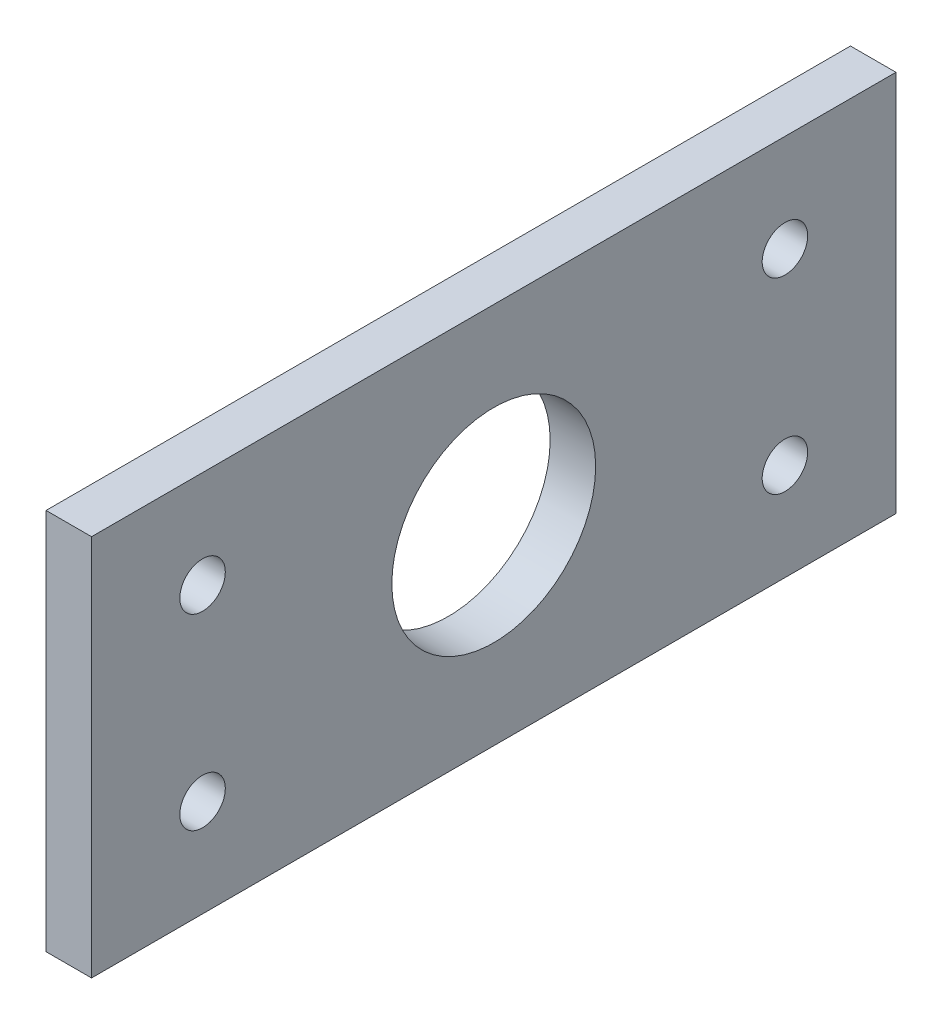
ISO-10303-21;
HEADER;
FILE_DESCRIPTION(('STEP AP214'),'2;1');
FILE_NAME('part.step','',(''),(''),'','','');
FILE_SCHEMA(('AUTOMOTIVE_DESIGN { 1 0 10303 214 1 1 1 1 }'));
ENDSEC;
DATA;
#1=APPLICATION_CONTEXT('core data for automotive mechanical design processes');
#2=APPLICATION_PROTOCOL_DEFINITION('international standard','automotive_design',2000,#1);
#3=PRODUCT_CONTEXT('',#1,'mechanical');
#4=PRODUCT('Part','Part','',(#3));
#5=PRODUCT_RELATED_PRODUCT_CATEGORY('part','',(#4));
#6=PRODUCT_DEFINITION_FORMATION('','',#4);
#7=PRODUCT_DEFINITION_CONTEXT('part definition',#1,'design');
#8=PRODUCT_DEFINITION('design','',#6,#7);
#9=PRODUCT_DEFINITION_SHAPE('','',#8);
#10=(LENGTH_UNIT() NAMED_UNIT(*) SI_UNIT(.MILLI.,.METRE.));
#11=(NAMED_UNIT(*) PLANE_ANGLE_UNIT() SI_UNIT($,.RADIAN.));
#12=(NAMED_UNIT(*) SI_UNIT($,.STERADIAN.) SOLID_ANGLE_UNIT());
#13=UNCERTAINTY_MEASURE_WITH_UNIT(LENGTH_MEASURE(1.E-05),#10,'distance_accuracy_value','');
#14=(GEOMETRIC_REPRESENTATION_CONTEXT(3) GLOBAL_UNCERTAINTY_ASSIGNED_CONTEXT((#13)) GLOBAL_UNIT_ASSIGNED_CONTEXT((#10,
#11,#12)) REPRESENTATION_CONTEXT('',''));
#15=CARTESIAN_POINT('',(0.,0.,0.));
#16=DIRECTION('',(0.,0.,1.));
#17=DIRECTION('',(1.,0.,0.));
#18=AXIS2_PLACEMENT_3D('',#15,#16,#17);
#19=CARTESIAN_POINT('',(6.35,0.,0.));
#20=DIRECTION('',(-1.,0.,0.));
#21=DIRECTION('',(0.,0.,1.));
#22=AXIS2_PLACEMENT_3D('',#19,#20,#21);
#23=PLANE('',#22);
#24=DIRECTION('',(0.,1.,0.));
#25=VECTOR('',#24,1.);
#26=CARTESIAN_POINT('',(6.35,-26.67,-56.134));
#27=LINE('',#26,#25);
#28=CARTESIAN_POINT('',(6.35,-26.67,-56.134));
#29=VERTEX_POINT('',#28);
#30=CARTESIAN_POINT('',(6.35,26.67,-56.134));
#31=VERTEX_POINT('',#30);
#32=EDGE_CURVE('E87',#29,#31,#27,.T.);
#33=ORIENTED_EDGE('',*,*,#32,.T.);
#34=DIRECTION('',(0.,0.,1.));
#35=VECTOR('',#34,1.);
#36=CARTESIAN_POINT('',(6.35,26.67,56.134));
#37=LINE('',#36,#35);
#38=CARTESIAN_POINT('',(6.35,26.67,56.134));
#39=VERTEX_POINT('',#38);
#40=EDGE_CURVE('E82',#31,#39,#37,.T.);
#41=ORIENTED_EDGE('',*,*,#40,.T.);
#42=DIRECTION('',(0.,-1.,0.));
#43=VECTOR('',#42,1.);
#44=CARTESIAN_POINT('',(6.35,-26.67,56.134));
#45=LINE('',#44,#43);
#46=CARTESIAN_POINT('',(6.35,-26.67,56.134));
#47=VERTEX_POINT('',#46);
#48=EDGE_CURVE('E85',#39,#47,#45,.T.);
#49=ORIENTED_EDGE('',*,*,#48,.T.);
#50=DIRECTION('',(0.,0.,-1.));
#51=VECTOR('',#50,1.);
#52=CARTESIAN_POINT('',(6.35,-26.67,56.134));
#53=LINE('',#52,#51);
#54=EDGE_CURVE('E52',#47,#29,#53,.T.);
#55=ORIENTED_EDGE('',*,*,#54,.T.);
#56=EDGE_LOOP('',(#33,#41,#49,#55));
#57=FACE_BOUND('',#56,.T.);
#58=CARTESIAN_POINT('',(6.35,0.,0.));
#59=DIRECTION('',(1.,0.,0.));
#60=DIRECTION('',(0.,0.,-1.));
#61=AXIS2_PLACEMENT_3D('',#58,#59,#60);
#62=CIRCLE('',#61,14.224);
#63=CARTESIAN_POINT('',(6.35,0.,-14.224));
#64=VERTEX_POINT('',#63);
#65=EDGE_CURVE('E102',#64,#64,#62,.T.);
#66=ORIENTED_EDGE('',*,*,#65,.F.);
#67=EDGE_LOOP('',(#66));
#68=FACE_BOUND('',#67,.T.);
#69=CARTESIAN_POINT('',(6.35,-13.081,40.64));
#70=DIRECTION('',(1.,0.,0.));
#71=DIRECTION('',(0.,0.,-1.));
#72=AXIS2_PLACEMENT_3D('',#69,#70,#71);
#73=CIRCLE('',#72,3.175);
#74=CARTESIAN_POINT('',(6.35,-13.081,37.465));
#75=VERTEX_POINT('',#74);
#76=EDGE_CURVE('E117',#75,#75,#73,.T.);
#77=ORIENTED_EDGE('',*,*,#76,.F.);
#78=EDGE_LOOP('',(#77));
#79=FACE_BOUND('',#78,.T.);
#80=CARTESIAN_POINT('',(6.35,-13.081,-40.64));
#81=DIRECTION('',(1.,0.,0.));
#82=DIRECTION('',(0.,0.,-1.));
#83=AXIS2_PLACEMENT_3D('',#80,#81,#82);
#84=CIRCLE('',#83,3.175);
#85=CARTESIAN_POINT('',(6.35,-13.081,-43.815));
#86=VERTEX_POINT('',#85);
#87=EDGE_CURVE('E123',#86,#86,#84,.T.);
#88=ORIENTED_EDGE('',*,*,#87,.F.);
#89=EDGE_LOOP('',(#88));
#90=FACE_BOUND('',#89,.T.);
#91=CARTESIAN_POINT('',(6.35,13.081,40.64));
#92=DIRECTION('',(1.,0.,0.));
#93=DIRECTION('',(0.,0.,-1.));
#94=AXIS2_PLACEMENT_3D('',#91,#92,#93);
#95=CIRCLE('',#94,3.175);
#96=CARTESIAN_POINT('',(6.35,13.081,37.465));
#97=VERTEX_POINT('',#96);
#98=EDGE_CURVE('E129',#97,#97,#95,.T.);
#99=ORIENTED_EDGE('',*,*,#98,.F.);
#100=EDGE_LOOP('',(#99));
#101=FACE_BOUND('',#100,.T.);
#102=CARTESIAN_POINT('',(6.35,13.081,-40.64));
#103=DIRECTION('',(1.,0.,0.));
#104=DIRECTION('',(0.,0.,-1.));
#105=AXIS2_PLACEMENT_3D('',#102,#103,#104);
#106=CIRCLE('',#105,3.175);
#107=CARTESIAN_POINT('',(6.35,13.081,-43.815));
#108=VERTEX_POINT('',#107);
#109=EDGE_CURVE('E135',#108,#108,#106,.T.);
#110=ORIENTED_EDGE('',*,*,#109,.F.);
#111=EDGE_LOOP('',(#110));
#112=FACE_BOUND('',#111,.T.);
#113=ADVANCED_FACE('F35',(#57,#68,#79,#90,#101,#112),#23,.F.);
#114=CARTESIAN_POINT('',(0.,0.,0.));
#115=DIRECTION('',(-1.,0.,0.));
#116=DIRECTION('',(0.,0.,1.));
#117=AXIS2_PLACEMENT_3D('',#114,#115,#116);
#118=PLANE('',#117);
#119=CARTESIAN_POINT('',(0.,13.081,40.64));
#120=DIRECTION('',(1.,0.,0.));
#121=DIRECTION('',(0.,0.,-1.));
#122=AXIS2_PLACEMENT_3D('',#119,#120,#121);
#123=CIRCLE('',#122,3.175);
#124=CARTESIAN_POINT('',(0.,13.081,37.465));
#125=VERTEX_POINT('',#124);
#126=EDGE_CURVE('E132',#125,#125,#123,.T.);
#127=ORIENTED_EDGE('',*,*,#126,.T.);
#128=EDGE_LOOP('',(#127));
#129=FACE_BOUND('',#128,.T.);
#130=CARTESIAN_POINT('',(0.,-13.081,40.64));
#131=DIRECTION('',(1.,0.,0.));
#132=DIRECTION('',(0.,0.,-1.));
#133=AXIS2_PLACEMENT_3D('',#130,#131,#132);
#134=CIRCLE('',#133,3.175);
#135=CARTESIAN_POINT('',(0.,-13.081,37.465));
#136=VERTEX_POINT('',#135);
#137=EDGE_CURVE('E120',#136,#136,#134,.T.);
#138=ORIENTED_EDGE('',*,*,#137,.T.);
#139=EDGE_LOOP('',(#138));
#140=FACE_BOUND('',#139,.T.);
#141=DIRECTION('',(0.,1.,0.));
#142=VECTOR('',#141,1.);
#143=CARTESIAN_POINT('',(0.,-26.67,-56.134));
#144=LINE('',#143,#142);
#145=CARTESIAN_POINT('',(0.,-26.67,-56.134));
#146=VERTEX_POINT('',#145);
#147=CARTESIAN_POINT('',(0.,26.67,-56.134));
#148=VERTEX_POINT('',#147);
#149=EDGE_CURVE('E99',#146,#148,#144,.T.);
#150=ORIENTED_EDGE('',*,*,#149,.F.);
#151=DIRECTION('',(0.,0.,-1.));
#152=VECTOR('',#151,1.);
#153=CARTESIAN_POINT('',(0.,-26.67,56.134));
#154=LINE('',#153,#152);
#155=CARTESIAN_POINT('',(0.,-26.67,56.134));
#156=VERTEX_POINT('',#155);
#157=EDGE_CURVE('E75',#156,#146,#154,.T.);
#158=ORIENTED_EDGE('',*,*,#157,.F.);
#159=DIRECTION('',(0.,-1.,0.));
#160=VECTOR('',#159,1.);
#161=CARTESIAN_POINT('',(0.,-26.67,56.134));
#162=LINE('',#161,#160);
#163=CARTESIAN_POINT('',(0.,26.67,56.134));
#164=VERTEX_POINT('',#163);
#165=EDGE_CURVE('E69',#164,#156,#162,.T.);
#166=ORIENTED_EDGE('',*,*,#165,.F.);
#167=DIRECTION('',(0.,0.,1.));
#168=VECTOR('',#167,1.);
#169=CARTESIAN_POINT('',(0.,26.67,56.134));
#170=LINE('',#169,#168);
#171=EDGE_CURVE('E91',#148,#164,#170,.T.);
#172=ORIENTED_EDGE('',*,*,#171,.F.);
#173=EDGE_LOOP('',(#150,#158,#166,#172));
#174=FACE_BOUND('',#173,.T.);
#175=CARTESIAN_POINT('',(0.,0.,0.));
#176=DIRECTION('',(1.,0.,0.));
#177=DIRECTION('',(0.,0.,-1.));
#178=AXIS2_PLACEMENT_3D('',#175,#176,#177);
#179=CIRCLE('',#178,14.224);
#180=CARTESIAN_POINT('',(0.,0.,-14.224));
#181=VERTEX_POINT('',#180);
#182=EDGE_CURVE('E114',#181,#181,#179,.T.);
#183=ORIENTED_EDGE('',*,*,#182,.T.);
#184=EDGE_LOOP('',(#183));
#185=FACE_BOUND('',#184,.T.);
#186=CARTESIAN_POINT('',(0.,-13.081,-40.64));
#187=DIRECTION('',(1.,0.,0.));
#188=DIRECTION('',(0.,0.,-1.));
#189=AXIS2_PLACEMENT_3D('',#186,#187,#188);
#190=CIRCLE('',#189,3.175);
#191=CARTESIAN_POINT('',(0.,-13.081,-43.815));
#192=VERTEX_POINT('',#191);
#193=EDGE_CURVE('E126',#192,#192,#190,.T.);
#194=ORIENTED_EDGE('',*,*,#193,.T.);
#195=EDGE_LOOP('',(#194));
#196=FACE_BOUND('',#195,.T.);
#197=CARTESIAN_POINT('',(0.,13.081,-40.64));
#198=DIRECTION('',(1.,0.,0.));
#199=DIRECTION('',(0.,0.,-1.));
#200=AXIS2_PLACEMENT_3D('',#197,#198,#199);
#201=CIRCLE('',#200,3.175);
#202=CARTESIAN_POINT('',(0.,13.081,-43.815));
#203=VERTEX_POINT('',#202);
#204=EDGE_CURVE('E138',#203,#203,#201,.T.);
#205=ORIENTED_EDGE('',*,*,#204,.T.);
#206=EDGE_LOOP('',(#205));
#207=FACE_BOUND('',#206,.T.);
#208=ADVANCED_FACE('F110',(#129,#140,#174,#185,#196,#207),#118,.T.);
#209=CARTESIAN_POINT('',(6.35,-26.67,-56.134));
#210=DIRECTION('',(0.,0.,1.));
#211=DIRECTION('',(1.,0.,0.));
#212=AXIS2_PLACEMENT_3D('',#209,#210,#211);
#213=PLANE('',#212);
#214=ORIENTED_EDGE('',*,*,#149,.T.);
#215=DIRECTION('',(-1.,0.,0.));
#216=VECTOR('',#215,1.);
#217=CARTESIAN_POINT('',(6.35,26.67,-56.134));
#218=LINE('',#217,#216);
#219=EDGE_CURVE('E11',#31,#148,#218,.T.);
#220=ORIENTED_EDGE('',*,*,#219,.F.);
#221=ORIENTED_EDGE('',*,*,#32,.F.);
#222=DIRECTION('',(-1.,0.,0.));
#223=VECTOR('',#222,1.);
#224=CARTESIAN_POINT('',(6.35,-26.67,-56.134));
#225=LINE('',#224,#223);
#226=EDGE_CURVE('E95',#29,#146,#225,.T.);
#227=ORIENTED_EDGE('',*,*,#226,.T.);
#228=EDGE_LOOP('',(#214,#220,#221,#227));
#229=FACE_BOUND('',#228,.T.);
#230=ADVANCED_FACE('F37',(#229),#213,.F.);
#231=CARTESIAN_POINT('',(6.35,26.67,56.134));
#232=DIRECTION('',(0.,-1.,0.));
#233=DIRECTION('',(0.,0.,-1.));
#234=AXIS2_PLACEMENT_3D('',#231,#232,#233);
#235=PLANE('',#234);
#236=ORIENTED_EDGE('',*,*,#171,.T.);
#237=DIRECTION('',(-1.,0.,0.));
#238=VECTOR('',#237,1.);
#239=CARTESIAN_POINT('',(6.35,26.67,56.134));
#240=LINE('',#239,#238);
#241=EDGE_CURVE('E44',#39,#164,#240,.T.);
#242=ORIENTED_EDGE('',*,*,#241,.F.);
#243=ORIENTED_EDGE('',*,*,#40,.F.);
#244=ORIENTED_EDGE('',*,*,#219,.T.);
#245=EDGE_LOOP('',(#236,#242,#243,#244));
#246=FACE_BOUND('',#245,.T.);
#247=ADVANCED_FACE('F90',(#246),#235,.F.);
#248=CARTESIAN_POINT('',(6.35,-26.67,56.134));
#249=DIRECTION('',(0.,0.,-1.));
#250=DIRECTION('',(-1.,0.,0.));
#251=AXIS2_PLACEMENT_3D('',#248,#249,#250);
#252=PLANE('',#251);
#253=ORIENTED_EDGE('',*,*,#165,.T.);
#254=DIRECTION('',(-1.,0.,0.));
#255=VECTOR('',#254,1.);
#256=CARTESIAN_POINT('',(6.35,-26.67,56.134));
#257=LINE('',#256,#255);
#258=EDGE_CURVE('E92',#47,#156,#257,.T.);
#259=ORIENTED_EDGE('',*,*,#258,.F.);
#260=ORIENTED_EDGE('',*,*,#48,.F.);
#261=ORIENTED_EDGE('',*,*,#241,.T.);
#262=EDGE_LOOP('',(#253,#259,#260,#261));
#263=FACE_BOUND('',#262,.T.);
#264=ADVANCED_FACE('F93',(#263),#252,.F.);
#265=CARTESIAN_POINT('',(6.35,-26.67,56.134));
#266=DIRECTION('',(0.,1.,0.));
#267=DIRECTION('',(0.,0.,1.));
#268=AXIS2_PLACEMENT_3D('',#265,#266,#267);
#269=PLANE('',#268);
#270=ORIENTED_EDGE('',*,*,#157,.T.);
#271=ORIENTED_EDGE('',*,*,#226,.F.);
#272=ORIENTED_EDGE('',*,*,#54,.F.);
#273=ORIENTED_EDGE('',*,*,#258,.T.);
#274=EDGE_LOOP('',(#270,#271,#272,#273));
#275=FACE_BOUND('',#274,.T.);
#276=ADVANCED_FACE('F107',(#275),#269,.F.);
#277=CARTESIAN_POINT('',(6.35,0.,0.));
#278=DIRECTION('',(-1.,0.,0.));
#279=DIRECTION('',(0.,0.,1.));
#280=AXIS2_PLACEMENT_3D('',#277,#278,#279);
#281=CYLINDRICAL_SURFACE('',#280,14.224);
#282=ORIENTED_EDGE('',*,*,#65,.T.);
#283=EDGE_LOOP('',(#282));
#284=FACE_BOUND('',#283,.T.);
#285=ORIENTED_EDGE('',*,*,#182,.F.);
#286=EDGE_LOOP('',(#285));
#287=FACE_BOUND('',#286,.T.);
#288=ADVANCED_FACE('F155',(#284,#287),#281,.F.);
#289=CARTESIAN_POINT('',(6.35,-13.081,40.64));
#290=DIRECTION('',(-1.,0.,0.));
#291=DIRECTION('',(0.,0.,1.));
#292=AXIS2_PLACEMENT_3D('',#289,#290,#291);
#293=CYLINDRICAL_SURFACE('',#292,3.175);
#294=ORIENTED_EDGE('',*,*,#76,.T.);
#295=EDGE_LOOP('',(#294));
#296=FACE_BOUND('',#295,.T.);
#297=ORIENTED_EDGE('',*,*,#137,.F.);
#298=EDGE_LOOP('',(#297));
#299=FACE_BOUND('',#298,.T.);
#300=ADVANCED_FACE('F201',(#296,#299),#293,.F.);
#301=CARTESIAN_POINT('',(6.35,-13.081,-40.64));
#302=DIRECTION('',(-1.,0.,0.));
#303=DIRECTION('',(0.,0.,1.));
#304=AXIS2_PLACEMENT_3D('',#301,#302,#303);
#305=CYLINDRICAL_SURFACE('',#304,3.175);
#306=ORIENTED_EDGE('',*,*,#87,.T.);
#307=EDGE_LOOP('',(#306));
#308=FACE_BOUND('',#307,.T.);
#309=ORIENTED_EDGE('',*,*,#193,.F.);
#310=EDGE_LOOP('',(#309));
#311=FACE_BOUND('',#310,.T.);
#312=ADVANCED_FACE('F209',(#308,#311),#305,.F.);
#313=CARTESIAN_POINT('',(6.35,13.081,40.64));
#314=DIRECTION('',(-1.,0.,0.));
#315=DIRECTION('',(0.,0.,1.));
#316=AXIS2_PLACEMENT_3D('',#313,#314,#315);
#317=CYLINDRICAL_SURFACE('',#316,3.175);
#318=ORIENTED_EDGE('',*,*,#98,.T.);
#319=EDGE_LOOP('',(#318));
#320=FACE_BOUND('',#319,.T.);
#321=ORIENTED_EDGE('',*,*,#126,.F.);
#322=EDGE_LOOP('',(#321));
#323=FACE_BOUND('',#322,.T.);
#324=ADVANCED_FACE('F217',(#320,#323),#317,.F.);
#325=CARTESIAN_POINT('',(6.35,13.081,-40.64));
#326=DIRECTION('',(-1.,0.,0.));
#327=DIRECTION('',(0.,0.,1.));
#328=AXIS2_PLACEMENT_3D('',#325,#326,#327);
#329=CYLINDRICAL_SURFACE('',#328,3.175);
#330=ORIENTED_EDGE('',*,*,#109,.T.);
#331=EDGE_LOOP('',(#330));
#332=FACE_BOUND('',#331,.T.);
#333=ORIENTED_EDGE('',*,*,#204,.F.);
#334=EDGE_LOOP('',(#333));
#335=FACE_BOUND('',#334,.T.);
#336=ADVANCED_FACE('F144',(#332,#335),#329,.F.);
#337=CLOSED_SHELL('',(#113,#208,#230,#247,#264,#276,#288,#300,#312,#324,#336));
#338=MANIFOLD_SOLID_BREP('B2',#337);
#339=ADVANCED_BREP_SHAPE_REPRESENTATION('',(#18,#338),#14);
#340=SHAPE_DEFINITION_REPRESENTATION(#9,#339);
ENDSEC;
END-ISO-10303-21;
